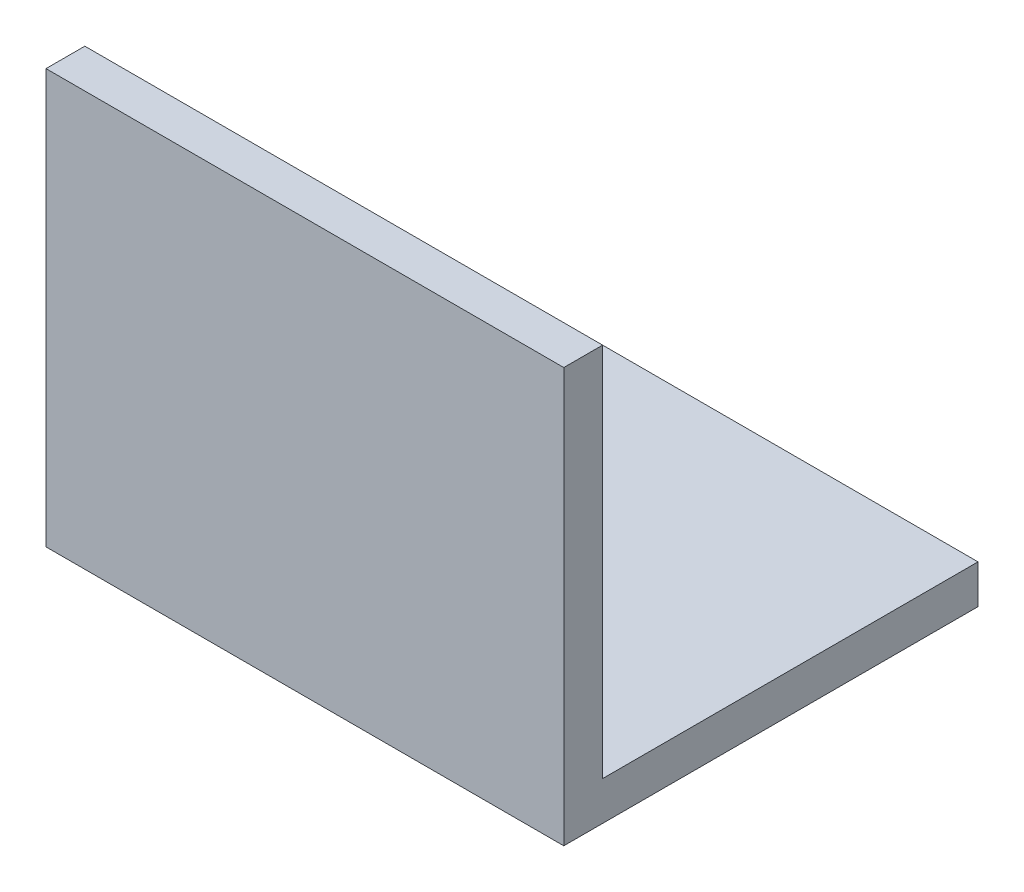
ISO-10303-21;
HEADER;
FILE_DESCRIPTION(('STEP AP214'),'2;1');
FILE_NAME('part.step','',(''),(''),'','','');
FILE_SCHEMA(('AUTOMOTIVE_DESIGN { 1 0 10303 214 1 1 1 1 }'));
ENDSEC;
DATA;
#1=APPLICATION_CONTEXT('core data for automotive mechanical design processes');
#2=APPLICATION_PROTOCOL_DEFINITION('international standard','automotive_design',2000,#1);
#3=PRODUCT_CONTEXT('',#1,'mechanical');
#4=PRODUCT('Part','Part','',(#3));
#5=PRODUCT_RELATED_PRODUCT_CATEGORY('part','',(#4));
#6=PRODUCT_DEFINITION_FORMATION('','',#4);
#7=PRODUCT_DEFINITION_CONTEXT('part definition',#1,'design');
#8=PRODUCT_DEFINITION('design','',#6,#7);
#9=PRODUCT_DEFINITION_SHAPE('','',#8);
#10=(LENGTH_UNIT() NAMED_UNIT(*) SI_UNIT(.MILLI.,.METRE.));
#11=(NAMED_UNIT(*) PLANE_ANGLE_UNIT() SI_UNIT($,.RADIAN.));
#12=(NAMED_UNIT(*) SI_UNIT($,.STERADIAN.) SOLID_ANGLE_UNIT());
#13=UNCERTAINTY_MEASURE_WITH_UNIT(LENGTH_MEASURE(1.E-05),#10,'distance_accuracy_value','');
#14=(GEOMETRIC_REPRESENTATION_CONTEXT(3) GLOBAL_UNCERTAINTY_ASSIGNED_CONTEXT((#13)) GLOBAL_UNIT_ASSIGNED_CONTEXT((#10,
#11,#12)) REPRESENTATION_CONTEXT('',''));
#15=CARTESIAN_POINT('',(0.,0.,0.));
#16=DIRECTION('',(0.,0.,1.));
#17=DIRECTION('',(1.,0.,0.));
#18=AXIS2_PLACEMENT_3D('',#15,#16,#17);
#19=CARTESIAN_POINT('',(40.,0.,0.));
#20=DIRECTION('',(0.,1.,0.));
#21=DIRECTION('',(0.,0.,1.));
#22=AXIS2_PLACEMENT_3D('',#19,#20,#21);
#23=PLANE('',#22);
#24=DIRECTION('',(0.,0.,-1.));
#25=VECTOR('',#24,1.);
#26=CARTESIAN_POINT('',(0.,0.,0.));
#27=LINE('',#26,#25);
#28=CARTESIAN_POINT('',(0.,0.,0.));
#29=VERTEX_POINT('',#28);
#30=CARTESIAN_POINT('',(0.,0.,-32.));
#31=VERTEX_POINT('',#30);
#32=EDGE_CURVE('E115',#29,#31,#27,.T.);
#33=ORIENTED_EDGE('',*,*,#32,.T.);
#34=DIRECTION('',(-1.,0.,0.));
#35=VECTOR('',#34,1.);
#36=CARTESIAN_POINT('',(40.,0.,-32.));
#37=LINE('',#36,#35);
#38=CARTESIAN_POINT('',(40.,0.,-32.));
#39=VERTEX_POINT('',#38);
#40=EDGE_CURVE('E11',#39,#31,#37,.T.);
#41=ORIENTED_EDGE('',*,*,#40,.F.);
#42=DIRECTION('',(0.,0.,-1.));
#43=VECTOR('',#42,1.);
#44=CARTESIAN_POINT('',(40.,0.,0.));
#45=LINE('',#44,#43);
#46=CARTESIAN_POINT('',(40.,0.,0.));
#47=VERTEX_POINT('',#46);
#48=EDGE_CURVE('E80',#47,#39,#45,.T.);
#49=ORIENTED_EDGE('',*,*,#48,.F.);
#50=DIRECTION('',(-1.,0.,0.));
#51=VECTOR('',#50,1.);
#52=CARTESIAN_POINT('',(40.,0.,0.));
#53=LINE('',#52,#51);
#54=EDGE_CURVE('E111',#47,#29,#53,.T.);
#55=ORIENTED_EDGE('',*,*,#54,.T.);
#56=EDGE_LOOP('',(#33,#41,#49,#55));
#57=FACE_BOUND('',#56,.T.);
#58=ADVANCED_FACE('F34',(#57),#23,.F.);
#59=CARTESIAN_POINT('',(40.,3.,-32.));
#60=DIRECTION('',(0.,0.,-1.));
#61=DIRECTION('',(-1.,0.,0.));
#62=AXIS2_PLACEMENT_3D('',#59,#60,#61);
#63=PLANE('',#62);
#64=DIRECTION('',(0.,-1.,0.));
#65=VECTOR('',#64,1.);
#66=CARTESIAN_POINT('',(0.,3.,-32.));
#67=LINE('',#66,#65);
#68=CARTESIAN_POINT('',(0.,3.,-32.));
#69=VERTEX_POINT('',#68);
#70=EDGE_CURVE('E118',#69,#31,#67,.T.);
#71=ORIENTED_EDGE('',*,*,#70,.F.);
#72=DIRECTION('',(-1.,0.,0.));
#73=VECTOR('',#72,1.);
#74=CARTESIAN_POINT('',(40.,3.,-32.));
#75=LINE('',#74,#73);
#76=CARTESIAN_POINT('',(40.,3.,-32.));
#77=VERTEX_POINT('',#76);
#78=EDGE_CURVE('E42',#77,#69,#75,.T.);
#79=ORIENTED_EDGE('',*,*,#78,.F.);
#80=DIRECTION('',(0.,-1.,0.));
#81=VECTOR('',#80,1.);
#82=CARTESIAN_POINT('',(40.,3.,-32.));
#83=LINE('',#82,#81);
#84=EDGE_CURVE('E204',#77,#39,#83,.T.);
#85=ORIENTED_EDGE('',*,*,#84,.T.);
#86=ORIENTED_EDGE('',*,*,#40,.T.);
#87=EDGE_LOOP('',(#71,#79,#85,#86));
#88=FACE_BOUND('',#87,.T.);
#89=ADVANCED_FACE('F136',(#88),#63,.T.);
#90=CARTESIAN_POINT('',(40.,3.,0.));
#91=DIRECTION('',(0.,1.,0.));
#92=DIRECTION('',(0.,0.,1.));
#93=AXIS2_PLACEMENT_3D('',#90,#91,#92);
#94=PLANE('',#93);
#95=DIRECTION('',(0.,0.,-1.));
#96=VECTOR('',#95,1.);
#97=CARTESIAN_POINT('',(0.,3.,0.));
#98=LINE('',#97,#96);
#99=CARTESIAN_POINT('',(0.,3.,-3.));
#100=VERTEX_POINT('',#99);
#101=EDGE_CURVE('E121',#100,#69,#98,.T.);
#102=ORIENTED_EDGE('',*,*,#101,.F.);
#103=DIRECTION('',(-1.,0.,0.));
#104=VECTOR('',#103,1.);
#105=CARTESIAN_POINT('',(40.,3.,-3.));
#106=LINE('',#105,#104);
#107=CARTESIAN_POINT('',(40.,3.,-3.));
#108=VERTEX_POINT('',#107);
#109=EDGE_CURVE('E101',#108,#100,#106,.T.);
#110=ORIENTED_EDGE('',*,*,#109,.F.);
#111=DIRECTION('',(0.,0.,-1.));
#112=VECTOR('',#111,1.);
#113=CARTESIAN_POINT('',(40.,3.,0.));
#114=LINE('',#113,#112);
#115=EDGE_CURVE('E107',#108,#77,#114,.T.);
#116=ORIENTED_EDGE('',*,*,#115,.T.);
#117=ORIENTED_EDGE('',*,*,#78,.T.);
#118=EDGE_LOOP('',(#102,#110,#116,#117));
#119=FACE_BOUND('',#118,.T.);
#120=ADVANCED_FACE('F133',(#119),#94,.T.);
#121=CARTESIAN_POINT('',(40.,32.,-3.));
#122=DIRECTION('',(0.,0.,-1.));
#123=DIRECTION('',(0.,1.,0.));
#124=AXIS2_PLACEMENT_3D('',#121,#122,#123);
#125=PLANE('',#124);
#126=DIRECTION('',(0.,-1.,0.));
#127=VECTOR('',#126,1.);
#128=CARTESIAN_POINT('',(0.,32.,-3.));
#129=LINE('',#128,#127);
#130=CARTESIAN_POINT('',(0.,32.,-3.));
#131=VERTEX_POINT('',#130);
#132=EDGE_CURVE('E96',#131,#100,#129,.T.);
#133=ORIENTED_EDGE('',*,*,#132,.F.);
#134=DIRECTION('',(-1.,0.,0.));
#135=VECTOR('',#134,1.);
#136=CARTESIAN_POINT('',(40.,32.,-3.));
#137=LINE('',#136,#135);
#138=CARTESIAN_POINT('',(40.,32.,-3.));
#139=VERTEX_POINT('',#138);
#140=EDGE_CURVE('E91',#139,#131,#137,.T.);
#141=ORIENTED_EDGE('',*,*,#140,.F.);
#142=DIRECTION('',(0.,-1.,0.));
#143=VECTOR('',#142,1.);
#144=CARTESIAN_POINT('',(40.,32.,-3.));
#145=LINE('',#144,#143);
#146=EDGE_CURVE('E94',#139,#108,#145,.T.);
#147=ORIENTED_EDGE('',*,*,#146,.T.);
#148=ORIENTED_EDGE('',*,*,#109,.T.);
#149=EDGE_LOOP('',(#133,#141,#147,#148));
#150=FACE_BOUND('',#149,.T.);
#151=ADVANCED_FACE('F93',(#150),#125,.T.);
#152=CARTESIAN_POINT('',(40.,32.,0.));
#153=DIRECTION('',(0.,1.,0.));
#154=DIRECTION('',(0.,0.,1.));
#155=AXIS2_PLACEMENT_3D('',#152,#153,#154);
#156=PLANE('',#155);
#157=DIRECTION('',(0.,0.,-1.));
#158=VECTOR('',#157,1.);
#159=CARTESIAN_POINT('',(0.,32.,0.));
#160=LINE('',#159,#158);
#161=CARTESIAN_POINT('',(0.,32.,0.));
#162=VERTEX_POINT('',#161);
#163=EDGE_CURVE('E125',#162,#131,#160,.T.);
#164=ORIENTED_EDGE('',*,*,#163,.F.);
#165=DIRECTION('',(-1.,0.,0.));
#166=VECTOR('',#165,1.);
#167=CARTESIAN_POINT('',(40.,32.,0.));
#168=LINE('',#167,#166);
#169=CARTESIAN_POINT('',(40.,32.,0.));
#170=VERTEX_POINT('',#169);
#171=EDGE_CURVE('E71',#170,#162,#168,.T.);
#172=ORIENTED_EDGE('',*,*,#171,.F.);
#173=DIRECTION('',(0.,0.,-1.));
#174=VECTOR('',#173,1.);
#175=CARTESIAN_POINT('',(40.,32.,0.));
#176=LINE('',#175,#174);
#177=EDGE_CURVE('E105',#170,#139,#176,.T.);
#178=ORIENTED_EDGE('',*,*,#177,.T.);
#179=ORIENTED_EDGE('',*,*,#140,.T.);
#180=EDGE_LOOP('',(#164,#172,#178,#179));
#181=FACE_BOUND('',#180,.T.);
#182=ADVANCED_FACE('F109',(#181),#156,.T.);
#183=CARTESIAN_POINT('',(40.,32.,0.));
#184=DIRECTION('',(0.,0.,-1.));
#185=DIRECTION('',(0.,1.,0.));
#186=AXIS2_PLACEMENT_3D('',#183,#184,#185);
#187=PLANE('',#186);
#188=DIRECTION('',(0.,-1.,0.));
#189=VECTOR('',#188,1.);
#190=CARTESIAN_POINT('',(0.,32.,0.));
#191=LINE('',#190,#189);
#192=EDGE_CURVE('E74',#162,#29,#191,.T.);
#193=ORIENTED_EDGE('',*,*,#192,.T.);
#194=ORIENTED_EDGE('',*,*,#54,.F.);
#195=DIRECTION('',(0.,-1.,0.));
#196=VECTOR('',#195,1.);
#197=CARTESIAN_POINT('',(40.,32.,0.));
#198=LINE('',#197,#196);
#199=EDGE_CURVE('E50',#170,#47,#198,.T.);
#200=ORIENTED_EDGE('',*,*,#199,.F.);
#201=ORIENTED_EDGE('',*,*,#171,.T.);
#202=EDGE_LOOP('',(#193,#194,#200,#201));
#203=FACE_BOUND('',#202,.T.);
#204=ADVANCED_FACE('F141',(#203),#187,.F.);
#205=CARTESIAN_POINT('',(40.,0.,0.));
#206=DIRECTION('',(-1.,0.,0.));
#207=DIRECTION('',(0.,0.,1.));
#208=AXIS2_PLACEMENT_3D('',#205,#206,#207);
#209=PLANE('',#208);
#210=ORIENTED_EDGE('',*,*,#48,.T.);
#211=ORIENTED_EDGE('',*,*,#84,.F.);
#212=ORIENTED_EDGE('',*,*,#115,.F.);
#213=ORIENTED_EDGE('',*,*,#146,.F.);
#214=ORIENTED_EDGE('',*,*,#177,.F.);
#215=ORIENTED_EDGE('',*,*,#199,.T.);
#216=EDGE_LOOP('',(#210,#211,#212,#213,#214,#215));
#217=FACE_BOUND('',#216,.T.);
#218=ADVANCED_FACE('F104',(#217),#209,.F.);
#219=CARTESIAN_POINT('',(0.,0.,0.));
#220=DIRECTION('',(-1.,0.,0.));
#221=DIRECTION('',(0.,0.,1.));
#222=AXIS2_PLACEMENT_3D('',#219,#220,#221);
#223=PLANE('',#222);
#224=ORIENTED_EDGE('',*,*,#32,.F.);
#225=ORIENTED_EDGE('',*,*,#192,.F.);
#226=ORIENTED_EDGE('',*,*,#163,.T.);
#227=ORIENTED_EDGE('',*,*,#132,.T.);
#228=ORIENTED_EDGE('',*,*,#101,.T.);
#229=ORIENTED_EDGE('',*,*,#70,.T.);
#230=EDGE_LOOP('',(#224,#225,#226,#227,#228,#229));
#231=FACE_BOUND('',#230,.T.);
#232=ADVANCED_FACE('F139',(#231),#223,.T.);
#233=CLOSED_SHELL('',(#58,#89,#120,#151,#182,#204,#218,#232));
#234=MANIFOLD_SOLID_BREP('B2',#233);
#235=ADVANCED_BREP_SHAPE_REPRESENTATION('',(#18,#234),#14);
#236=SHAPE_DEFINITION_REPRESENTATION(#9,#235);
ENDSEC;
END-ISO-10303-21;
